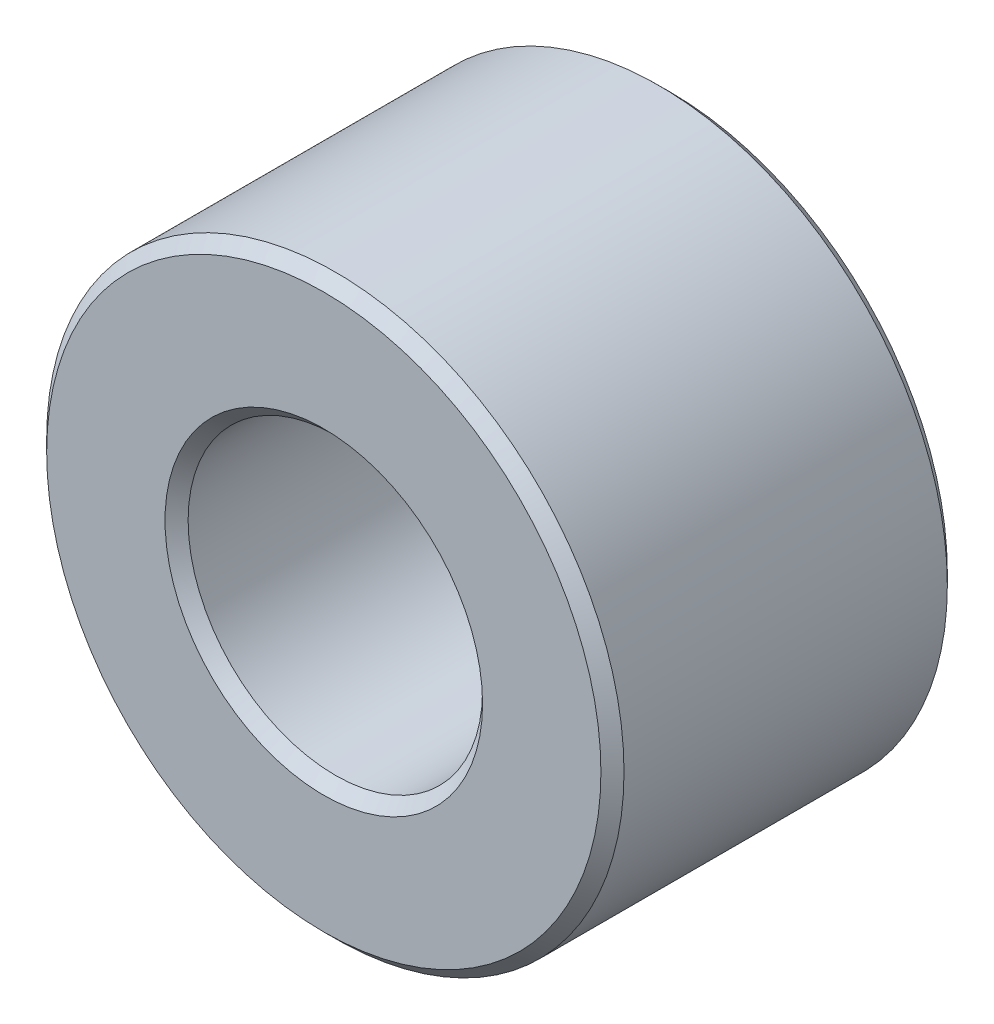
ISO-10303-21;
HEADER;
FILE_DESCRIPTION(('STEP AP214'),'2;1');
FILE_NAME('part.step','',(''),(''),'','','');
FILE_SCHEMA(('AUTOMOTIVE_DESIGN { 1 0 10303 214 1 1 1 1 }'));
ENDSEC;
DATA;
#1=APPLICATION_CONTEXT('core data for automotive mechanical design processes');
#2=APPLICATION_PROTOCOL_DEFINITION('international standard','automotive_design',2000,#1);
#3=PRODUCT_CONTEXT('',#1,'mechanical');
#4=PRODUCT('Part','Part','',(#3));
#5=PRODUCT_RELATED_PRODUCT_CATEGORY('part','',(#4));
#6=PRODUCT_DEFINITION_FORMATION('','',#4);
#7=PRODUCT_DEFINITION_CONTEXT('part definition',#1,'design');
#8=PRODUCT_DEFINITION('design','',#6,#7);
#9=PRODUCT_DEFINITION_SHAPE('','',#8);
#10=(LENGTH_UNIT() NAMED_UNIT(*) SI_UNIT(.MILLI.,.METRE.));
#11=(NAMED_UNIT(*) PLANE_ANGLE_UNIT() SI_UNIT($,.RADIAN.));
#12=(NAMED_UNIT(*) SI_UNIT($,.STERADIAN.) SOLID_ANGLE_UNIT());
#13=UNCERTAINTY_MEASURE_WITH_UNIT(LENGTH_MEASURE(1.E-05),#10,'distance_accuracy_value','');
#14=(GEOMETRIC_REPRESENTATION_CONTEXT(3) GLOBAL_UNCERTAINTY_ASSIGNED_CONTEXT((#13)) GLOBAL_UNIT_ASSIGNED_CONTEXT((#10,
#11,#12)) REPRESENTATION_CONTEXT('',''));
#15=CARTESIAN_POINT('',(0.,0.,0.));
#16=DIRECTION('',(0.,0.,1.));
#17=DIRECTION('',(1.,0.,0.));
#18=AXIS2_PLACEMENT_3D('',#15,#16,#17);
#19=CARTESIAN_POINT('',(0.,0.,6.));
#20=DIRECTION('',(0.,0.,1.));
#21=DIRECTION('',(1.,0.,0.));
#22=AXIS2_PLACEMENT_3D('',#19,#20,#21);
#23=PLANE('',#22);
#24=CARTESIAN_POINT('',(0.,0.,6.));
#25=DIRECTION('',(0.,0.,1.));
#26=DIRECTION('',(1.,0.,0.));
#27=AXIS2_PLACEMENT_3D('',#24,#25,#26);
#28=CIRCLE('',#27,2.75);
#29=CARTESIAN_POINT('',(2.75,0.,6.));
#30=VERTEX_POINT('',#29);
#31=EDGE_CURVE('E12',#30,#30,#28,.F.);
#32=ORIENTED_EDGE('',*,*,#31,.T.);
#33=EDGE_LOOP('',(#32));
#34=FACE_BOUND('',#33,.T.);
#35=CARTESIAN_POINT('',(0.,0.,6.));
#36=DIRECTION('',(0.,0.,1.));
#37=DIRECTION('',(1.,0.,0.));
#38=AXIS2_PLACEMENT_3D('',#35,#36,#37);
#39=CIRCLE('',#38,4.8);
#40=CARTESIAN_POINT('',(4.8,0.,6.));
#41=VERTEX_POINT('',#40);
#42=EDGE_CURVE('E51',#41,#41,#39,.T.);
#43=ORIENTED_EDGE('',*,*,#42,.T.);
#44=EDGE_LOOP('',(#43));
#45=FACE_BOUND('',#44,.T.);
#46=ADVANCED_FACE('F44',(#34,#45),#23,.T.);
#47=CARTESIAN_POINT('',(0.,0.,0.));
#48=DIRECTION('',(0.,0.,1.));
#49=DIRECTION('',(1.,0.,0.));
#50=AXIS2_PLACEMENT_3D('',#47,#48,#49);
#51=PLANE('',#50);
#52=CARTESIAN_POINT('',(0.,0.,0.));
#53=DIRECTION('',(0.,0.,1.));
#54=DIRECTION('',(1.,0.,0.));
#55=AXIS2_PLACEMENT_3D('',#52,#53,#54);
#56=CIRCLE('',#55,4.8);
#57=CARTESIAN_POINT('',(4.8,0.,0.));
#58=VERTEX_POINT('',#57);
#59=EDGE_CURVE('E64',#58,#58,#56,.F.);
#60=ORIENTED_EDGE('',*,*,#59,.T.);
#61=EDGE_LOOP('',(#60));
#62=FACE_BOUND('',#61,.T.);
#63=CARTESIAN_POINT('',(0.,0.,0.));
#64=DIRECTION('',(0.,0.,1.));
#65=DIRECTION('',(1.,0.,0.));
#66=AXIS2_PLACEMENT_3D('',#63,#64,#65);
#67=CIRCLE('',#66,2.75);
#68=CARTESIAN_POINT('',(2.75,0.,0.));
#69=VERTEX_POINT('',#68);
#70=EDGE_CURVE('E67',#69,#69,#67,.T.);
#71=ORIENTED_EDGE('',*,*,#70,.T.);
#72=EDGE_LOOP('',(#71));
#73=FACE_BOUND('',#72,.T.);
#74=ADVANCED_FACE('F88',(#62,#73),#51,.F.);
#75=CARTESIAN_POINT('',(0.,0.,6.));
#76=DIRECTION('',(0.,0.,-1.));
#77=DIRECTION('',(-1.,0.,0.));
#78=AXIS2_PLACEMENT_3D('',#75,#76,#77);
#79=CYLINDRICAL_SURFACE('',#78,5.);
#80=CARTESIAN_POINT('',(0.,0.,0.199999999999998));
#81=DIRECTION('',(0.,0.,1.));
#82=DIRECTION('',(1.,0.,0.));
#83=AXIS2_PLACEMENT_3D('',#80,#81,#82);
#84=CIRCLE('',#83,5.);
#85=CARTESIAN_POINT('',(5.,0.,0.199999999999998));
#86=VERTEX_POINT('',#85);
#87=EDGE_CURVE('E70',#86,#86,#84,.T.);
#88=ORIENTED_EDGE('',*,*,#87,.T.);
#89=EDGE_LOOP('',(#88));
#90=FACE_BOUND('',#89,.T.);
#91=CARTESIAN_POINT('',(0.,0.,5.8));
#92=DIRECTION('',(0.,0.,1.));
#93=DIRECTION('',(1.,0.,0.));
#94=AXIS2_PLACEMENT_3D('',#91,#92,#93);
#95=CIRCLE('',#94,5.);
#96=CARTESIAN_POINT('',(5.,0.,5.8));
#97=VERTEX_POINT('',#96);
#98=EDGE_CURVE('E73',#97,#97,#95,.F.);
#99=ORIENTED_EDGE('',*,*,#98,.T.);
#100=EDGE_LOOP('',(#99));
#101=FACE_BOUND('',#100,.T.);
#102=ADVANCED_FACE('F77',(#90,#101),#79,.T.);
#103=CARTESIAN_POINT('',(0.,0.,6.));
#104=DIRECTION('',(0.,0.,-1.));
#105=DIRECTION('',(-1.,0.,0.));
#106=AXIS2_PLACEMENT_3D('',#103,#104,#105);
#107=CYLINDRICAL_SURFACE('',#106,2.55);
#108=CARTESIAN_POINT('',(0.,0.,0.200000000000003));
#109=DIRECTION('',(0.,0.,1.));
#110=DIRECTION('',(1.,0.,0.));
#111=AXIS2_PLACEMENT_3D('',#108,#109,#110);
#112=CIRCLE('',#111,2.55);
#113=CARTESIAN_POINT('',(2.55,0.,0.200000000000003));
#114=VERTEX_POINT('',#113);
#115=EDGE_CURVE('E55',#114,#114,#112,.F.);
#116=ORIENTED_EDGE('',*,*,#115,.T.);
#117=EDGE_LOOP('',(#116));
#118=FACE_BOUND('',#117,.T.);
#119=CARTESIAN_POINT('',(0.,0.,5.8));
#120=DIRECTION('',(0.,0.,1.));
#121=DIRECTION('',(1.,0.,0.));
#122=AXIS2_PLACEMENT_3D('',#119,#120,#121);
#123=CIRCLE('',#122,2.55);
#124=CARTESIAN_POINT('',(2.55,0.,5.8));
#125=VERTEX_POINT('',#124);
#126=EDGE_CURVE('E59',#125,#125,#123,.T.);
#127=ORIENTED_EDGE('',*,*,#126,.T.);
#128=EDGE_LOOP('',(#127));
#129=FACE_BOUND('',#128,.T.);
#130=ADVANCED_FACE('F96',(#118,#129),#107,.F.);
#131=CARTESIAN_POINT('',(0.,0.,0.199999999999998));
#132=DIRECTION('',(0.,0.,1.));
#133=DIRECTION('',(1.,0.,0.));
#134=AXIS2_PLACEMENT_3D('',#131,#132,#133);
#135=CONICAL_SURFACE('',#134,5.,0.785398163397455);
#136=ORIENTED_EDGE('',*,*,#59,.F.);
#137=EDGE_LOOP('',(#136));
#138=FACE_BOUND('',#137,.T.);
#139=ORIENTED_EDGE('',*,*,#87,.F.);
#140=EDGE_LOOP('',(#139));
#141=FACE_BOUND('',#140,.T.);
#142=ADVANCED_FACE('F101',(#138,#141),#135,.T.);
#143=CARTESIAN_POINT('',(0.,0.,0.));
#144=DIRECTION('',(0.,0.,-1.));
#145=DIRECTION('',(-1.,0.,0.));
#146=AXIS2_PLACEMENT_3D('',#143,#144,#145);
#147=CONICAL_SURFACE('',#146,2.75,0.785398163397443);
#148=ORIENTED_EDGE('',*,*,#115,.F.);
#149=EDGE_LOOP('',(#148));
#150=FACE_BOUND('',#149,.T.);
#151=ORIENTED_EDGE('',*,*,#70,.F.);
#152=EDGE_LOOP('',(#151));
#153=FACE_BOUND('',#152,.T.);
#154=ADVANCED_FACE('F85',(#150,#153),#147,.F.);
#155=CARTESIAN_POINT('',(0.,0.,5.8));
#156=DIRECTION('',(0.,0.,1.));
#157=DIRECTION('',(1.,0.,0.));
#158=AXIS2_PLACEMENT_3D('',#155,#156,#157);
#159=CONICAL_SURFACE('',#158,2.55,0.785398163397454);
#160=ORIENTED_EDGE('',*,*,#31,.F.);
#161=EDGE_LOOP('',(#160));
#162=FACE_BOUND('',#161,.T.);
#163=ORIENTED_EDGE('',*,*,#126,.F.);
#164=EDGE_LOOP('',(#163));
#165=FACE_BOUND('',#164,.T.);
#166=ADVANCED_FACE('F81',(#162,#165),#159,.F.);
#167=CARTESIAN_POINT('',(0.,0.,6.));
#168=DIRECTION('',(0.,0.,-1.));
#169=DIRECTION('',(-1.,0.,0.));
#170=AXIS2_PLACEMENT_3D('',#167,#168,#169);
#171=CONICAL_SURFACE('',#170,4.8,0.785398163397448);
#172=ORIENTED_EDGE('',*,*,#98,.F.);
#173=EDGE_LOOP('',(#172));
#174=FACE_BOUND('',#173,.T.);
#175=ORIENTED_EDGE('',*,*,#42,.F.);
#176=EDGE_LOOP('',(#175));
#177=FACE_BOUND('',#176,.T.);
#178=ADVANCED_FACE('F46',(#174,#177),#171,.T.);
#179=CLOSED_SHELL('',(#46,#74,#102,#130,#142,#154,#166,#178));
#180=MANIFOLD_SOLID_BREP('B2',#179);
#181=ADVANCED_BREP_SHAPE_REPRESENTATION('',(#18,#180),#14);
#182=SHAPE_DEFINITION_REPRESENTATION(#9,#181);
ENDSEC;
END-ISO-10303-21;
